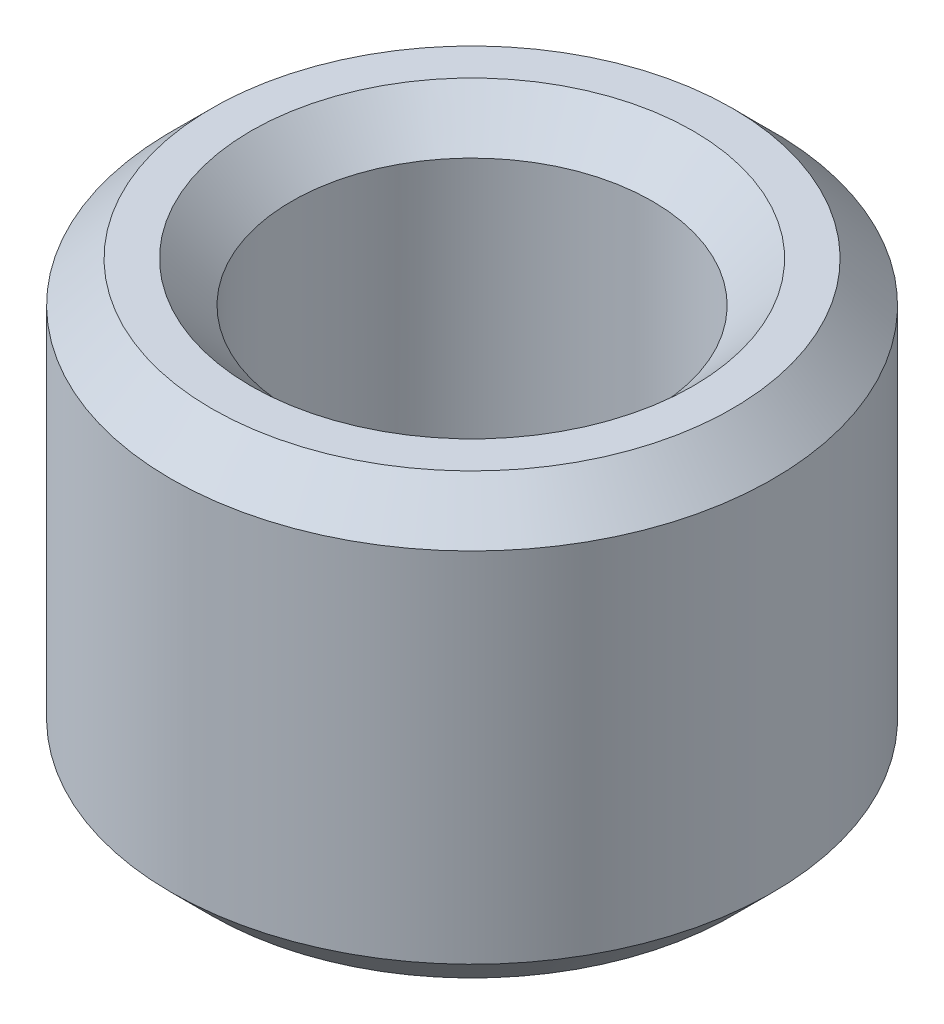
ISO-10303-21;
HEADER;
FILE_DESCRIPTION(('STEP AP214'),'2;1');
FILE_NAME('part.step','',(''),(''),'','','');
FILE_SCHEMA(('AUTOMOTIVE_DESIGN { 1 0 10303 214 1 1 1 1 }'));
ENDSEC;
DATA;
#1=APPLICATION_CONTEXT('core data for automotive mechanical design processes');
#2=APPLICATION_PROTOCOL_DEFINITION('international standard','automotive_design',2000,#1);
#3=PRODUCT_CONTEXT('',#1,'mechanical');
#4=PRODUCT('Part','Part','',(#3));
#5=PRODUCT_RELATED_PRODUCT_CATEGORY('part','',(#4));
#6=PRODUCT_DEFINITION_FORMATION('','',#4);
#7=PRODUCT_DEFINITION_CONTEXT('part definition',#1,'design');
#8=PRODUCT_DEFINITION('design','',#6,#7);
#9=PRODUCT_DEFINITION_SHAPE('','',#8);
#10=(LENGTH_UNIT() NAMED_UNIT(*) SI_UNIT(.MILLI.,.METRE.));
#11=(NAMED_UNIT(*) PLANE_ANGLE_UNIT() SI_UNIT($,.RADIAN.));
#12=(NAMED_UNIT(*) SI_UNIT($,.STERADIAN.) SOLID_ANGLE_UNIT());
#13=UNCERTAINTY_MEASURE_WITH_UNIT(LENGTH_MEASURE(1.E-05),#10,'distance_accuracy_value','');
#14=(GEOMETRIC_REPRESENTATION_CONTEXT(3) GLOBAL_UNCERTAINTY_ASSIGNED_CONTEXT((#13)) GLOBAL_UNIT_ASSIGNED_CONTEXT((#10,
#11,#12)) REPRESENTATION_CONTEXT('',''));
#15=CARTESIAN_POINT('',(0.,0.,0.));
#16=DIRECTION('',(0.,0.,1.));
#17=DIRECTION('',(1.,0.,0.));
#18=AXIS2_PLACEMENT_3D('',#15,#16,#17);
#19=CARTESIAN_POINT('',(0.,18.2442116105314,0.));
#20=DIRECTION('',(0.,-1.,0.));
#21=DIRECTION('',(0.,0.,-1.));
#22=AXIS2_PLACEMENT_3D('',#19,#20,#21);
#23=CYLINDRICAL_SURFACE('',#22,12.5);
#24=CARTESIAN_POINT('',(0.,1.68741653012366,0.));
#25=DIRECTION('',(0.,1.,0.));
#26=DIRECTION('',(0.,0.,1.));
#27=AXIS2_PLACEMENT_3D('',#24,#25,#26);
#28=CIRCLE('',#27,12.5);
#29=CARTESIAN_POINT('',(0.,1.68741653012366,12.5));
#30=VERTEX_POINT('',#29);
#31=EDGE_CURVE('E10',#30,#30,#28,.T.);
#32=ORIENTED_EDGE('',*,*,#31,.T.);
#33=EDGE_LOOP('',(#32));
#34=FACE_BOUND('',#33,.T.);
#35=CARTESIAN_POINT('',(0.,16.5567950804077,0.));
#36=DIRECTION('',(0.,1.,0.));
#37=DIRECTION('',(0.,0.,1.));
#38=AXIS2_PLACEMENT_3D('',#35,#36,#37);
#39=CIRCLE('',#38,12.5);
#40=CARTESIAN_POINT('',(0.,16.5567950804077,12.5));
#41=VERTEX_POINT('',#40);
#42=EDGE_CURVE('E50',#41,#41,#39,.F.);
#43=ORIENTED_EDGE('',*,*,#42,.T.);
#44=EDGE_LOOP('',(#43));
#45=FACE_BOUND('',#44,.T.);
#46=ADVANCED_FACE('F39',(#34,#45),#23,.T.);
#47=CARTESIAN_POINT('',(0.,18.2442116105314,0.));
#48=DIRECTION('',(0.,1.,0.));
#49=DIRECTION('',(0.,0.,1.));
#50=AXIS2_PLACEMENT_3D('',#47,#48,#49);
#51=PLANE('',#50);
#52=CARTESIAN_POINT('',(0.,18.2442116105314,0.));
#53=DIRECTION('',(0.,1.,0.));
#54=DIRECTION('',(0.,0.,1.));
#55=AXIS2_PLACEMENT_3D('',#52,#53,#54);
#56=CIRCLE('',#55,9.18235167425117);
#57=CARTESIAN_POINT('',(0.,18.2442116105314,9.18235167425117));
#58=VERTEX_POINT('',#57);
#59=EDGE_CURVE('E58',#58,#58,#56,.F.);
#60=ORIENTED_EDGE('',*,*,#59,.T.);
#61=EDGE_LOOP('',(#60));
#62=FACE_BOUND('',#61,.T.);
#63=CARTESIAN_POINT('',(0.,18.2442116105314,0.));
#64=DIRECTION('',(0.,1.,0.));
#65=DIRECTION('',(0.,0.,1.));
#66=AXIS2_PLACEMENT_3D('',#63,#64,#65);
#67=CIRCLE('',#66,10.8125834698763);
#68=CARTESIAN_POINT('',(0.,18.2442116105314,10.8125834698763));
#69=VERTEX_POINT('',#68);
#70=EDGE_CURVE('E61',#69,#69,#67,.T.);
#71=ORIENTED_EDGE('',*,*,#70,.T.);
#72=EDGE_LOOP('',(#71));
#73=FACE_BOUND('',#72,.T.);
#74=ADVANCED_FACE('F88',(#62,#73),#51,.T.);
#75=CARTESIAN_POINT('',(0.,0.,0.));
#76=DIRECTION('',(0.,1.,0.));
#77=DIRECTION('',(0.,0.,1.));
#78=AXIS2_PLACEMENT_3D('',#75,#76,#77);
#79=PLANE('',#78);
#80=CARTESIAN_POINT('',(0.,0.,0.));
#81=DIRECTION('',(0.,1.,0.));
#82=DIRECTION('',(0.,0.,1.));
#83=AXIS2_PLACEMENT_3D('',#80,#81,#82);
#84=CIRCLE('',#83,9.18235167425115);
#85=CARTESIAN_POINT('',(0.,0.,-9.18235167425115));
#86=VERTEX_POINT('',#85);
#87=EDGE_CURVE('E51',#86,#86,#84,.T.);
#88=ORIENTED_EDGE('',*,*,#87,.T.);
#89=EDGE_LOOP('',(#88));
#90=FACE_BOUND('',#89,.T.);
#91=CARTESIAN_POINT('',(0.,0.,0.));
#92=DIRECTION('',(0.,1.,0.));
#93=DIRECTION('',(0.,0.,1.));
#94=AXIS2_PLACEMENT_3D('',#91,#92,#93);
#95=CIRCLE('',#94,10.8125834698763);
#96=CARTESIAN_POINT('',(0.,0.,10.8125834698763));
#97=VERTEX_POINT('',#96);
#98=EDGE_CURVE('E54',#97,#97,#95,.F.);
#99=ORIENTED_EDGE('',*,*,#98,.T.);
#100=EDGE_LOOP('',(#99));
#101=FACE_BOUND('',#100,.T.);
#102=ADVANCED_FACE('F83',(#90,#101),#79,.F.);
#103=CARTESIAN_POINT('',(0.,18.2442116105314,0.));
#104=DIRECTION('',(0.,-1.,0.));
#105=DIRECTION('',(0.,0.,-1.));
#106=AXIS2_PLACEMENT_3D('',#103,#104,#105);
#107=CYLINDRICAL_SURFACE('',#106,7.49493514412749);
#108=CARTESIAN_POINT('',(0.,16.5567950804078,0.));
#109=DIRECTION('',(0.,1.,0.));
#110=DIRECTION('',(0.,0.,1.));
#111=AXIS2_PLACEMENT_3D('',#108,#109,#110);
#112=CIRCLE('',#111,7.49493514412749);
#113=CARTESIAN_POINT('',(0.,16.5567950804078,7.49493514412749));
#114=VERTEX_POINT('',#113);
#115=EDGE_CURVE('E67',#114,#114,#112,.T.);
#116=ORIENTED_EDGE('',*,*,#115,.T.);
#117=EDGE_LOOP('',(#116));
#118=FACE_BOUND('',#117,.T.);
#119=CARTESIAN_POINT('',(0.,1.68741653012368,0.));
#120=DIRECTION('',(0.,1.,0.));
#121=DIRECTION('',(0.,0.,1.));
#122=AXIS2_PLACEMENT_3D('',#119,#120,#121);
#123=CIRCLE('',#122,7.49493514412749);
#124=CARTESIAN_POINT('',(0.,1.68741653012368,-7.49493514412749));
#125=VERTEX_POINT('',#124);
#126=EDGE_CURVE('E69',#125,#125,#123,.F.);
#127=ORIENTED_EDGE('',*,*,#126,.T.);
#128=EDGE_LOOP('',(#127));
#129=FACE_BOUND('',#128,.T.);
#130=ADVANCED_FACE('F71',(#118,#129),#107,.F.);
#131=CARTESIAN_POINT('',(0.,16.5567950804078,0.));
#132=DIRECTION('',(0.,1.,0.));
#133=DIRECTION('',(0.,0.,1.));
#134=AXIS2_PLACEMENT_3D('',#131,#132,#133);
#135=CONICAL_SURFACE('',#134,7.49493514412749,0.785398163397453);
#136=ORIENTED_EDGE('',*,*,#59,.F.);
#137=EDGE_LOOP('',(#136));
#138=FACE_BOUND('',#137,.T.);
#139=ORIENTED_EDGE('',*,*,#115,.F.);
#140=EDGE_LOOP('',(#139));
#141=FACE_BOUND('',#140,.T.);
#142=ADVANCED_FACE('F77',(#138,#141),#135,.F.);
#143=CARTESIAN_POINT('',(0.,0.,0.));
#144=DIRECTION('',(0.,-1.,0.));
#145=DIRECTION('',(0.,0.,-1.));
#146=AXIS2_PLACEMENT_3D('',#143,#144,#145);
#147=CONICAL_SURFACE('',#146,9.18235167425115,0.785398163397444);
#148=CARTESIAN_POINT('',(0.,1.68741653012368,-7.49493514412749));
#149=CARTESIAN_POINT('',(0.,1.66983927460156,-7.51251239964961));
#150=CARTESIAN_POINT('',(0.,1.65226201907944,-7.53008965517173));
#151=CARTESIAN_POINT('',(0.,1.61710750803519,-7.56524416621597));
#152=CARTESIAN_POINT('',(0.,1.59953025251307,-7.58282142173809));
#153=CARTESIAN_POINT('',(0.,1.56437574146883,-7.61797593278234));
#154=CARTESIAN_POINT('',(0.,1.54679848594671,-7.63555318830446));
#155=CARTESIAN_POINT('',(0.,1.51164397490246,-7.6707076993487));
#156=CARTESIAN_POINT('',(0.,1.49406671938034,-7.68828495487082));
#157=CARTESIAN_POINT('',(0.,1.4589122083361,-7.72343946591507));
#158=CARTESIAN_POINT('',(0.,1.44133495281398,-7.74101672143719));
#159=CARTESIAN_POINT('',(0.,1.40618044176973,-7.77617123248143));
#160=CARTESIAN_POINT('',(0.,1.38860318624761,-7.79374848800355));
#161=CARTESIAN_POINT('',(0.,1.35344867520337,-7.8289029990478));
#162=CARTESIAN_POINT('',(0.,1.33587141968125,-7.84648025456992));
#163=CARTESIAN_POINT('',(0.,1.300716908637,-7.88163476561416));
#164=CARTESIAN_POINT('',(0.,1.28313965311488,-7.89921202113628));
#165=CARTESIAN_POINT('',(0.,1.24798514207064,-7.93436653218053));
#166=CARTESIAN_POINT('',(0.,1.23040788654852,-7.95194378770265));
#167=CARTESIAN_POINT('',(0.,1.19525337550427,-7.98709829874689));
#168=CARTESIAN_POINT('',(0.,1.17767611998215,-8.00467555426901));
#169=CARTESIAN_POINT('',(0.,1.14252160893791,-8.03983006531325));
#170=CARTESIAN_POINT('',(0.,1.12494435341579,-8.05740732083537));
#171=CARTESIAN_POINT('',(0.,1.08978984237154,-8.09256183187962));
#172=CARTESIAN_POINT('',(0.,1.07221258684942,-8.11013908740174));
#173=CARTESIAN_POINT('',(0.,1.03705807580518,-8.14529359844598));
#174=CARTESIAN_POINT('',(0.,1.01948082028306,-8.1628708539681));
#175=CARTESIAN_POINT('',(0.,0.984326309238814,-8.19802536501235));
#176=CARTESIAN_POINT('',(0.,0.966749053716693,-8.21560262053447));
#177=CARTESIAN_POINT('',(0.,0.931594542672449,-8.25075713157871));
#178=CARTESIAN_POINT('',(0.,0.914017287150327,-8.26833438710083));
#179=CARTESIAN_POINT('',(0.,0.878862776106084,-8.30348889814508));
#180=CARTESIAN_POINT('',(0.,0.861285520583962,-8.3210661536672));
#181=CARTESIAN_POINT('',(0.,0.826131009539719,-8.35622066471144));
#182=CARTESIAN_POINT('',(0.,0.808553754017597,-8.37379792023356));
#183=CARTESIAN_POINT('',(0.,0.773399242973354,-8.40895243127781));
#184=CARTESIAN_POINT('',(0.,0.755821987451232,-8.42652968679993));
#185=CARTESIAN_POINT('',(0.,0.720667476406989,-8.46168419784417));
#186=CARTESIAN_POINT('',(0.,0.703090220884867,-8.47926145336629));
#187=CARTESIAN_POINT('',(0.,0.667935709840624,-8.51441596441054));
#188=CARTESIAN_POINT('',(0.,0.650358454318502,-8.53199321993266));
#189=CARTESIAN_POINT('',(0.,0.615203943274259,-8.5671477309769));
#190=CARTESIAN_POINT('',(0.,0.597626687752137,-8.58472498649902));
#191=CARTESIAN_POINT('',(0.,0.562472176707894,-8.61987949754326));
#192=CARTESIAN_POINT('',(0.,0.544894921185772,-8.63745675306539));
#193=CARTESIAN_POINT('',(0.,0.509740410141529,-8.67261126410963));
#194=CARTESIAN_POINT('',(0.,0.492163154619407,-8.69018851963175));
#195=CARTESIAN_POINT('',(0.,0.457008643575164,-8.725343030676));
#196=CARTESIAN_POINT('',(0.,0.439431388053042,-8.74292028619812));
#197=CARTESIAN_POINT('',(0.,0.404276877008799,-8.77807479724236));
#198=CARTESIAN_POINT('',(0.,0.386699621486677,-8.79565205276448));
#199=CARTESIAN_POINT('',(0.,0.351545110442434,-8.83080656380872));
#200=CARTESIAN_POINT('',(0.,0.333967854920312,-8.84838381933084));
#201=CARTESIAN_POINT('',(0.,0.298813343876069,-8.88353833037509));
#202=CARTESIAN_POINT('',(0.,0.281236088353947,-8.90111558589721));
#203=CARTESIAN_POINT('',(0.,0.246081577309703,-8.93627009694145));
#204=CARTESIAN_POINT('',(0.,0.228504321787582,-8.95384735246357));
#205=CARTESIAN_POINT('',(0.,0.193349810743339,-8.98900186350782));
#206=CARTESIAN_POINT('',(0.,0.175772555221217,-9.00657911902994));
#207=CARTESIAN_POINT('',(0.,0.140618044176974,-9.04173363007418));
#208=CARTESIAN_POINT('',(0.,0.123040788654852,-9.0593108855963));
#209=CARTESIAN_POINT('',(0.,0.0878862776106084,-9.09446539664055));
#210=CARTESIAN_POINT('',(0.,0.0703090220884866,-9.11204265216267));
#211=CARTESIAN_POINT('',(0.,0.0351545110442433,-9.14719716320691));
#212=CARTESIAN_POINT('',(0.,0.0175772555221217,-9.16477441872903));
#213=CARTESIAN_POINT('',(0.,0.,-9.18235167425115));
#214=B_SPLINE_CURVE_WITH_KNOTS('',3,(#148,#149,#150,#151,#152,#153,#154,#155,#156,#157,#158,
#159,#160,#161,#162,#163,#164,#165,#166,#167,#168,#169,#170,#171,#172,#173,#174,#175,#176,#177,
#178,#179,#180,#181,#182,#183,#184,#185,#186,#187,#188,#189,#190,#191,#192,#193,#194,#195,#196,
#197,#198,#199,#200,#201,#202,#203,#204,#205,#206,#207,#208,#209,#210,#211,#212,#213),
.UNSPECIFIED.,.F.,.F.,(4,2,2,2,2,2,2,2,2,2,2,2,2,2,2,2,2,2,2,2,2,2,2,2,2,2,2,2,2,2,2,2,4),(0.,
0.0745739794460451,0.14914795889209,0.223721938338136,0.298295917784181,0.372869897230227,
0.447443876676272,0.522017856122317,0.596591835568362,0.671165815014408,0.745739794460453,
0.820313773906498,0.894887753352543,0.969461732798588,1.04403571224463,1.11860969169068,
1.19318367113672,1.26775765058277,1.34233163002881,1.41690560947486,1.4914795889209,
1.56605356836695,1.640627547813,1.71520152725904,1.78977550670509,1.86434948615113,
1.93892346559718,2.01349744504322,2.08807142448927,2.16264540393531,2.23721938338136,
2.3117933628274,2.38636734227345),.UNSPECIFIED.);
#215=EDGE_CURVE('BSEAM73',#125,#86,#214,.T.);
#216=ORIENTED_EDGE('',*,*,#126,.F.);
#217=ORIENTED_EDGE('',*,*,#87,.F.);
#218=ORIENTED_EDGE('',*,*,#215,.T.);
#219=ORIENTED_EDGE('',*,*,#215,.F.);
#220=EDGE_LOOP('',(#216,#218,#217,#219));
#221=FACE_BOUND('',#220,.T.);
#222=ADVANCED_FACE('F73',(#221),#147,.F.);
#223=CARTESIAN_POINT('',(0.,1.68741653012366,0.));
#224=DIRECTION('',(0.,1.,0.));
#225=DIRECTION('',(0.,0.,1.));
#226=AXIS2_PLACEMENT_3D('',#223,#224,#225);
#227=CONICAL_SURFACE('',#226,12.5,0.785398163397451);
#228=CARTESIAN_POINT('',(0.,0.,10.8125834698763));
#229=CARTESIAN_POINT('',(0.,0.0175772555221212,10.8301607253985));
#230=CARTESIAN_POINT('',(0.,0.0351545110442426,10.8477379809206));
#231=CARTESIAN_POINT('',(0.,0.0703090220884855,10.8828924919648));
#232=CARTESIAN_POINT('',(0.,0.0878862776106069,10.9004697474869));
#233=CARTESIAN_POINT('',(0.,0.12304078865485,10.9356242585312));
#234=CARTESIAN_POINT('',(0.,0.140618044176971,10.9532015140533));
#235=CARTESIAN_POINT('',(0.,0.175772555221214,10.9883560250976));
#236=CARTESIAN_POINT('',(0.,0.193349810743336,11.0059332806197));
#237=CARTESIAN_POINT('',(0.,0.228504321787578,11.0410877916639));
#238=CARTESIAN_POINT('',(0.,0.2460815773097,11.058665047186));
#239=CARTESIAN_POINT('',(0.,0.281236088353943,11.0938195582303));
#240=CARTESIAN_POINT('',(0.,0.298813343876064,11.1113968137524));
#241=CARTESIAN_POINT('',(0.,0.333967854920307,11.1465513247966));
#242=CARTESIAN_POINT('',(0.,0.351545110442428,11.1641285803188));
#243=CARTESIAN_POINT('',(0.,0.386699621486671,11.199283091363));
#244=CARTESIAN_POINT('',(0.,0.404276877008793,11.2168603468851));
#245=CARTESIAN_POINT('',(0.,0.439431388053036,11.2520148579294));
#246=CARTESIAN_POINT('',(0.,0.457008643575157,11.2695921134515));
#247=CARTESIAN_POINT('',(0.,0.4921631546194,11.3047466244957));
#248=CARTESIAN_POINT('',(0.,0.509740410141521,11.3223238800179));
#249=CARTESIAN_POINT('',(0.,0.544894921185764,11.3574783910621));
#250=CARTESIAN_POINT('',(0.,0.562472176707886,11.3750556465842));
#251=CARTESIAN_POINT('',(0.,0.597626687752129,11.4102101576285));
#252=CARTESIAN_POINT('',(0.,0.61520394327425,11.4277874131506));
#253=CARTESIAN_POINT('',(0.,0.650358454318493,11.4629419241948));
#254=CARTESIAN_POINT('',(0.,0.667935709840614,11.480519179717));
#255=CARTESIAN_POINT('',(0.,0.703090220884857,11.5156736907612));
#256=CARTESIAN_POINT('',(0.,0.720667476406979,11.5332509462833));
#257=CARTESIAN_POINT('',(0.,0.755821987451221,11.5684054573276));
#258=CARTESIAN_POINT('',(0.,0.773399242973343,11.5859827128497));
#259=CARTESIAN_POINT('',(0.,0.808553754017586,11.6211372238939));
#260=CARTESIAN_POINT('',(0.,0.826131009539707,11.638714479416));
#261=CARTESIAN_POINT('',(0.,0.86128552058395,11.6738689904603));
#262=CARTESIAN_POINT('',(0.,0.878862776106071,11.6914462459824));
#263=CARTESIAN_POINT('',(0.,0.914017287150314,11.7266007570267));
#264=CARTESIAN_POINT('',(0.,0.931594542672436,11.7441780125488));
#265=CARTESIAN_POINT('',(0.,0.966749053716679,11.779332523593));
#266=CARTESIAN_POINT('',(0.,0.9843263092388,11.7969097791151));
#267=CARTESIAN_POINT('',(0.,1.01948082028304,11.8320642901594));
#268=CARTESIAN_POINT('',(0.,1.03705807580516,11.8496415456815));
#269=CARTESIAN_POINT('',(0.,1.07221258684941,11.8847960567257));
#270=CARTESIAN_POINT('',(0.,1.08978984237153,11.9023733122479));
#271=CARTESIAN_POINT('',(0.,1.12494435341577,11.9375278232921));
#272=CARTESIAN_POINT('',(0.,1.14252160893789,11.9551050788142));
#273=CARTESIAN_POINT('',(0.,1.17767611998214,11.9902595898585));
#274=CARTESIAN_POINT('',(0.,1.19525337550426,12.0078368453806));
#275=CARTESIAN_POINT('',(0.,1.2304078865485,12.0429913564248));
#276=CARTESIAN_POINT('',(0.,1.24798514207062,12.060568611947));
#277=CARTESIAN_POINT('',(0.,1.28313965311486,12.0957231229912));
#278=CARTESIAN_POINT('',(0.,1.30071690863699,12.1133003785133));
#279=CARTESIAN_POINT('',(0.,1.33587141968123,12.1484548895576));
#280=CARTESIAN_POINT('',(0.,1.35344867520335,12.1660321450797));
#281=CARTESIAN_POINT('',(0.,1.38860318624759,12.2011866561239));
#282=CARTESIAN_POINT('',(0.,1.40618044176971,12.2187639116461));
#283=CARTESIAN_POINT('',(0.,1.44133495281396,12.2539184226903));
#284=CARTESIAN_POINT('',(0.,1.45891220833608,12.2714956782124));
#285=CARTESIAN_POINT('',(0.,1.49406671938032,12.3066501892567));
#286=CARTESIAN_POINT('',(0.,1.51164397490244,12.3242274447788));
#287=CARTESIAN_POINT('',(0.,1.54679848594669,12.359381955823));
#288=CARTESIAN_POINT('',(0.,1.56437574146881,12.3769592113451));
#289=CARTESIAN_POINT('',(0.,1.59953025251305,12.4121137223894));
#290=CARTESIAN_POINT('',(0.,1.61710750803517,12.4296909779115));
#291=CARTESIAN_POINT('',(0.,1.65226201907941,12.4648454889558));
#292=CARTESIAN_POINT('',(0.,1.66983927460154,12.4824227444779));
#293=CARTESIAN_POINT('',(0.,1.68741653012366,12.5));
#294=B_SPLINE_CURVE_WITH_KNOTS('',3,(#228,#229,#230,#231,#232,#233,#234,#235,#236,#237,#238,
#239,#240,#241,#242,#243,#244,#245,#246,#247,#248,#249,#250,#251,#252,#253,#254,#255,#256,#257,
#258,#259,#260,#261,#262,#263,#264,#265,#266,#267,#268,#269,#270,#271,#272,#273,#274,#275,#276,
#277,#278,#279,#280,#281,#282,#283,#284,#285,#286,#287,#288,#289,#290,#291,#292,#293),
.UNSPECIFIED.,.F.,.F.,(4,2,2,2,2,2,2,2,2,2,2,2,2,2,2,2,2,2,2,2,2,2,2,2,2,2,2,2,2,2,2,2,4),(0.,
0.0745739794460447,0.149147958892089,0.223721938338134,0.298295917784179,0.372869897230223,
0.447443876676268,0.522017856122313,0.596591835568357,0.671165815014402,0.745739794460447,
0.820313773906491,0.894887753352536,0.969461732798581,1.04403571224463,1.11860969169067,
1.19318367113671,1.26775765058276,1.3423316300288,1.41690560947485,1.4914795889209,
1.56605356836694,1.64062754781298,1.71520152725903,1.78977550670507,1.86434948615112,
1.93892346559716,2.01349744504321,2.08807142448925,2.1626454039353,2.23721938338134,
2.31179336282739,2.38636734227343),.UNSPECIFIED.);
#295=EDGE_CURVE('BSEAM76',#97,#30,#294,.T.);
#296=ORIENTED_EDGE('',*,*,#98,.F.);
#297=ORIENTED_EDGE('',*,*,#31,.F.);
#298=ORIENTED_EDGE('',*,*,#295,.T.);
#299=ORIENTED_EDGE('',*,*,#295,.F.);
#300=EDGE_LOOP('',(#296,#298,#297,#299));
#301=FACE_BOUND('',#300,.T.);
#302=ADVANCED_FACE('F76',(#301),#227,.T.);
#303=CARTESIAN_POINT('',(0.,18.2442116105314,0.));
#304=DIRECTION('',(0.,-1.,0.));
#305=DIRECTION('',(0.,0.,-1.));
#306=AXIS2_PLACEMENT_3D('',#303,#304,#305);
#307=CONICAL_SURFACE('',#306,10.8125834698763,0.785398163397445);
#308=ORIENTED_EDGE('',*,*,#42,.F.);
#309=EDGE_LOOP('',(#308));
#310=FACE_BOUND('',#309,.T.);
#311=ORIENTED_EDGE('',*,*,#70,.F.);
#312=EDGE_LOOP('',(#311));
#313=FACE_BOUND('',#312,.T.);
#314=ADVANCED_FACE('F45',(#310,#313),#307,.T.);
#315=CLOSED_SHELL('',(#46,#74,#102,#130,#142,#222,#302,#314));
#316=MANIFOLD_SOLID_BREP('B2',#315);
#317=ADVANCED_BREP_SHAPE_REPRESENTATION('',(#18,#316),#14);
#318=SHAPE_DEFINITION_REPRESENTATION(#9,#317);
ENDSEC;
END-ISO-10303-21;
